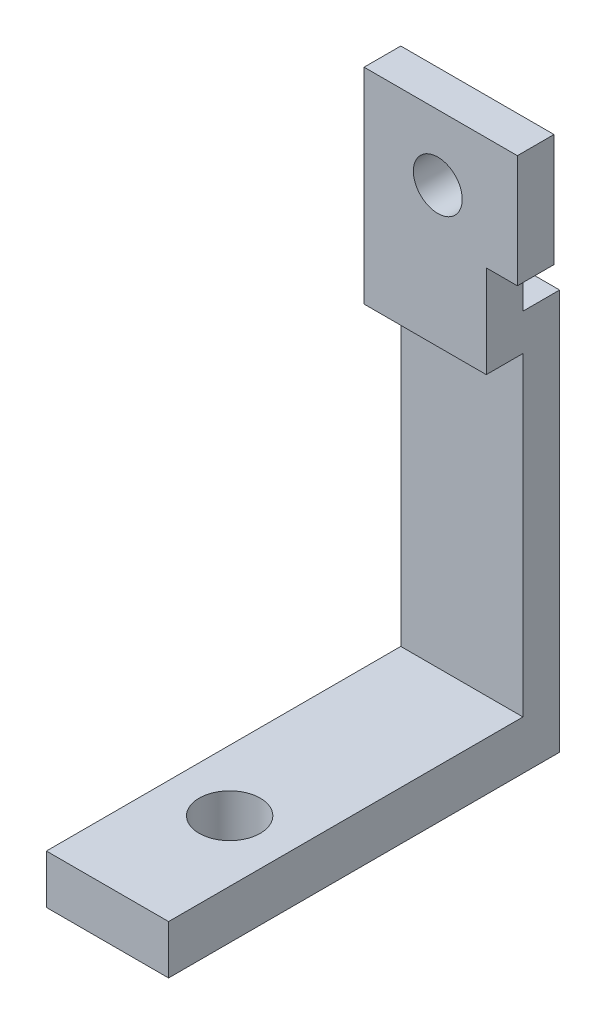
ISO-10303-21;
HEADER;
FILE_DESCRIPTION(('STEP AP214'),'2;1');
FILE_NAME('part.step','',(''),(''),'','','');
FILE_SCHEMA(('AUTOMOTIVE_DESIGN { 1 0 10303 214 1 1 1 1 }'));
ENDSEC;
DATA;
#1=APPLICATION_CONTEXT('core data for automotive mechanical design processes');
#2=APPLICATION_PROTOCOL_DEFINITION('international standard','automotive_design',2000,#1);
#3=PRODUCT_CONTEXT('',#1,'mechanical');
#4=PRODUCT('Part','Part','',(#3));
#5=PRODUCT_RELATED_PRODUCT_CATEGORY('part','',(#4));
#6=PRODUCT_DEFINITION_FORMATION('','',#4);
#7=PRODUCT_DEFINITION_CONTEXT('part definition',#1,'design');
#8=PRODUCT_DEFINITION('design','',#6,#7);
#9=PRODUCT_DEFINITION_SHAPE('','',#8);
#10=(LENGTH_UNIT() NAMED_UNIT(*) SI_UNIT(.MILLI.,.METRE.));
#11=(NAMED_UNIT(*) PLANE_ANGLE_UNIT() SI_UNIT($,.RADIAN.));
#12=(NAMED_UNIT(*) SI_UNIT($,.STERADIAN.) SOLID_ANGLE_UNIT());
#13=UNCERTAINTY_MEASURE_WITH_UNIT(LENGTH_MEASURE(1.E-05),#10,'distance_accuracy_value','');
#14=(GEOMETRIC_REPRESENTATION_CONTEXT(3) GLOBAL_UNCERTAINTY_ASSIGNED_CONTEXT((#13)) GLOBAL_UNIT_ASSIGNED_CONTEXT((#10,
#11,#12)) REPRESENTATION_CONTEXT('',''));
#15=CARTESIAN_POINT('',(0.,0.,0.));
#16=DIRECTION('',(0.,0.,1.));
#17=DIRECTION('',(1.,0.,0.));
#18=AXIS2_PLACEMENT_3D('',#15,#16,#17);
#19=CARTESIAN_POINT('',(0.,32.76,-29.));
#20=DIRECTION('',(0.,0.,-1.));
#21=DIRECTION('',(-1.,0.,0.));
#22=AXIS2_PLACEMENT_3D('',#19,#20,#21);
#23=PLANE('',#22);
#24=DIRECTION('',(1.,0.,0.));
#25=VECTOR('',#24,1.);
#26=CARTESIAN_POINT('',(0.,29.76,-29.));
#27=LINE('',#26,#25);
#28=CARTESIAN_POINT('',(0.,29.76,-29.));
#29=VERTEX_POINT('',#28);
#30=CARTESIAN_POINT('',(10.,29.76,-29.));
#31=VERTEX_POINT('',#30);
#32=EDGE_CURVE('E234',#29,#31,#27,.T.);
#33=ORIENTED_EDGE('',*,*,#32,.F.);
#34=DIRECTION('',(0.,-1.,0.));
#35=VECTOR('',#34,1.);
#36=CARTESIAN_POINT('',(0.,32.76,-29.));
#37=LINE('',#36,#35);
#38=CARTESIAN_POINT('',(0.,4.,-29.));
#39=VERTEX_POINT('',#38);
#40=EDGE_CURVE('E80',#29,#39,#37,.T.);
#41=ORIENTED_EDGE('',*,*,#40,.T.);
#42=DIRECTION('',(1.,0.,0.));
#43=VECTOR('',#42,1.);
#44=CARTESIAN_POINT('',(0.,4.,-29.));
#45=LINE('',#44,#43);
#46=CARTESIAN_POINT('',(10.,4.,-29.));
#47=VERTEX_POINT('',#46);
#48=EDGE_CURVE('E177',#39,#47,#45,.T.);
#49=ORIENTED_EDGE('',*,*,#48,.T.);
#50=DIRECTION('',(0.,-1.,0.));
#51=VECTOR('',#50,1.);
#52=CARTESIAN_POINT('',(10.,32.76,-29.));
#53=LINE('',#52,#51);
#54=EDGE_CURVE('E173',#31,#47,#53,.T.);
#55=ORIENTED_EDGE('',*,*,#54,.F.);
#56=EDGE_LOOP('',(#33,#41,#49,#55));
#57=FACE_BOUND('',#56,.T.);
#58=ADVANCED_FACE('F63',(#57),#23,.F.);
#59=CARTESIAN_POINT('',(0.,4.,0.));
#60=DIRECTION('',(0.,-1.,0.));
#61=DIRECTION('',(0.,0.,-1.));
#62=AXIS2_PLACEMENT_3D('',#59,#60,#61);
#63=PLANE('',#62);
#64=CARTESIAN_POINT('',(5.,4.,-10.));
#65=DIRECTION('',(0.,1.,0.));
#66=DIRECTION('',(0.,0.,1.));
#67=AXIS2_PLACEMENT_3D('',#64,#65,#66);
#68=CIRCLE('',#67,2.5);
#69=CARTESIAN_POINT('',(5.,4.,-7.5));
#70=VERTEX_POINT('',#69);
#71=EDGE_CURVE('E144',#70,#70,#68,.T.);
#72=ORIENTED_EDGE('',*,*,#71,.F.);
#73=EDGE_LOOP('',(#72));
#74=FACE_BOUND('',#73,.T.);
#75=ORIENTED_EDGE('',*,*,#48,.F.);
#76=DIRECTION('',(0.,0.,1.));
#77=VECTOR('',#76,1.);
#78=CARTESIAN_POINT('',(0.,4.,0.));
#79=LINE('',#78,#77);
#80=CARTESIAN_POINT('',(0.,4.,0.));
#81=VERTEX_POINT('',#80);
#82=EDGE_CURVE('E121',#39,#81,#79,.T.);
#83=ORIENTED_EDGE('',*,*,#82,.T.);
#84=DIRECTION('',(1.,0.,0.));
#85=VECTOR('',#84,1.);
#86=CARTESIAN_POINT('',(0.,4.,0.));
#87=LINE('',#86,#85);
#88=CARTESIAN_POINT('',(10.,4.,0.));
#89=VERTEX_POINT('',#88);
#90=EDGE_CURVE('E89',#81,#89,#87,.T.);
#91=ORIENTED_EDGE('',*,*,#90,.T.);
#92=DIRECTION('',(0.,0.,-1.));
#93=VECTOR('',#92,1.);
#94=CARTESIAN_POINT('',(10.,4.,0.));
#95=LINE('',#94,#93);
#96=EDGE_CURVE('E133',#89,#47,#95,.T.);
#97=ORIENTED_EDGE('',*,*,#96,.T.);
#98=EDGE_LOOP('',(#75,#83,#91,#97));
#99=FACE_BOUND('',#98,.T.);
#100=ADVANCED_FACE('F350',(#74,#99),#63,.F.);
#101=CARTESIAN_POINT('',(0.,4.,0.));
#102=DIRECTION('',(1.,0.,0.));
#103=DIRECTION('',(0.,0.,-1.));
#104=AXIS2_PLACEMENT_3D('',#101,#102,#103);
#105=PLANE('',#104);
#106=DIRECTION('',(0.,0.,1.));
#107=VECTOR('',#106,1.);
#108=CARTESIAN_POINT('',(0.,0.,0.));
#109=LINE('',#108,#107);
#110=CARTESIAN_POINT('',(0.,0.,-32.));
#111=VERTEX_POINT('',#110);
#112=CARTESIAN_POINT('',(0.,0.,0.));
#113=VERTEX_POINT('',#112);
#114=EDGE_CURVE('E128',#111,#113,#109,.T.);
#115=ORIENTED_EDGE('',*,*,#114,.T.);
#116=DIRECTION('',(0.,-1.,0.));
#117=VECTOR('',#116,1.);
#118=CARTESIAN_POINT('',(0.,4.,0.));
#119=LINE('',#118,#117);
#120=EDGE_CURVE('E12',#81,#113,#119,.T.);
#121=ORIENTED_EDGE('',*,*,#120,.F.);
#122=ORIENTED_EDGE('',*,*,#82,.F.);
#123=ORIENTED_EDGE('',*,*,#40,.F.);
#124=DIRECTION('',(0.,0.,-1.));
#125=VECTOR('',#124,1.);
#126=CARTESIAN_POINT('',(0.,29.76,-26.));
#127=LINE('',#126,#125);
#128=CARTESIAN_POINT('',(0.,29.76,-26.));
#129=VERTEX_POINT('',#128);
#130=EDGE_CURVE('E225',#129,#29,#127,.T.);
#131=ORIENTED_EDGE('',*,*,#130,.F.);
#132=DIRECTION('',(0.,1.,0.));
#133=VECTOR('',#132,1.);
#134=CARTESIAN_POINT('',(0.,29.76,-26.));
#135=LINE('',#134,#133);
#136=CARTESIAN_POINT('',(0.,46.5523620927674,-26.));
#137=VERTEX_POINT('',#136);
#138=EDGE_CURVE('E253',#129,#137,#135,.T.);
#139=ORIENTED_EDGE('',*,*,#138,.T.);
#140=DIRECTION('',(0.,0.,-1.));
#141=VECTOR('',#140,1.);
#142=CARTESIAN_POINT('',(0.,46.5523620927674,-26.));
#143=LINE('',#142,#141);
#144=CARTESIAN_POINT('',(0.,46.5523620927674,-29.));
#145=VERTEX_POINT('',#144);
#146=EDGE_CURVE('E206',#137,#145,#143,.T.);
#147=ORIENTED_EDGE('',*,*,#146,.T.);
#148=DIRECTION('',(0.,1.,0.));
#149=VECTOR('',#148,1.);
#150=CARTESIAN_POINT('',(0.,29.76,-29.));
#151=LINE('',#150,#149);
#152=CARTESIAN_POINT('',(0.,32.76,-29.));
#153=VERTEX_POINT('',#152);
#154=EDGE_CURVE('E239',#153,#145,#151,.T.);
#155=ORIENTED_EDGE('',*,*,#154,.F.);
#156=DIRECTION('',(0.,0.,1.));
#157=VECTOR('',#156,1.);
#158=CARTESIAN_POINT('',(0.,32.76,-32.));
#159=LINE('',#158,#157);
#160=CARTESIAN_POINT('',(0.,32.76,-32.));
#161=VERTEX_POINT('',#160);
#162=EDGE_CURVE('E131',#161,#153,#159,.T.);
#163=ORIENTED_EDGE('',*,*,#162,.F.);
#164=DIRECTION('',(0.,-1.,0.));
#165=VECTOR('',#164,1.);
#166=CARTESIAN_POINT('',(0.,4.,-32.));
#167=LINE('',#166,#165);
#168=EDGE_CURVE('E113',#161,#111,#167,.T.);
#169=ORIENTED_EDGE('',*,*,#168,.T.);
#170=EDGE_LOOP('',(#115,#121,#122,#123,#131,#139,#147,#155,#163,#169));
#171=FACE_BOUND('',#170,.T.);
#172=ADVANCED_FACE('F65',(#171),#105,.F.);
#173=CARTESIAN_POINT('',(0.,4.,0.));
#174=DIRECTION('',(0.,0.,-1.));
#175=DIRECTION('',(-1.,0.,0.));
#176=AXIS2_PLACEMENT_3D('',#173,#174,#175);
#177=PLANE('',#176);
#178=DIRECTION('',(1.,0.,0.));
#179=VECTOR('',#178,1.);
#180=CARTESIAN_POINT('',(0.,0.,0.));
#181=LINE('',#180,#179);
#182=CARTESIAN_POINT('',(10.,0.,0.));
#183=VERTEX_POINT('',#182);
#184=EDGE_CURVE('E136',#113,#183,#181,.T.);
#185=ORIENTED_EDGE('',*,*,#184,.T.);
#186=DIRECTION('',(0.,-1.,0.));
#187=VECTOR('',#186,1.);
#188=CARTESIAN_POINT('',(10.,4.,0.));
#189=LINE('',#188,#187);
#190=EDGE_CURVE('E73',#89,#183,#189,.T.);
#191=ORIENTED_EDGE('',*,*,#190,.F.);
#192=ORIENTED_EDGE('',*,*,#90,.F.);
#193=ORIENTED_EDGE('',*,*,#120,.T.);
#194=EDGE_LOOP('',(#185,#191,#192,#193));
#195=FACE_BOUND('',#194,.T.);
#196=ADVANCED_FACE('F160',(#195),#177,.F.);
#197=CARTESIAN_POINT('',(10.,4.,0.));
#198=DIRECTION('',(-1.,0.,0.));
#199=DIRECTION('',(0.,0.,1.));
#200=AXIS2_PLACEMENT_3D('',#197,#198,#199);
#201=PLANE('',#200);
#202=DIRECTION('',(0.,0.,-1.));
#203=VECTOR('',#202,1.);
#204=CARTESIAN_POINT('',(10.,0.,0.));
#205=LINE('',#204,#203);
#206=CARTESIAN_POINT('',(10.,0.,-32.));
#207=VERTEX_POINT('',#206);
#208=EDGE_CURVE('E122',#183,#207,#205,.T.);
#209=ORIENTED_EDGE('',*,*,#208,.T.);
#210=DIRECTION('',(0.,-1.,0.));
#211=VECTOR('',#210,1.);
#212=CARTESIAN_POINT('',(10.,4.,-32.));
#213=LINE('',#212,#211);
#214=CARTESIAN_POINT('',(10.,32.76,-32.));
#215=VERTEX_POINT('',#214);
#216=EDGE_CURVE('E116',#215,#207,#213,.T.);
#217=ORIENTED_EDGE('',*,*,#216,.F.);
#218=DIRECTION('',(0.,0.,-1.));
#219=VECTOR('',#218,1.);
#220=CARTESIAN_POINT('',(10.,32.76,-32.));
#221=LINE('',#220,#219);
#222=CARTESIAN_POINT('',(10.,32.76,-29.));
#223=VERTEX_POINT('',#222);
#224=EDGE_CURVE('E183',#223,#215,#221,.T.);
#225=ORIENTED_EDGE('',*,*,#224,.F.);
#226=DIRECTION('',(0.,1.,0.));
#227=VECTOR('',#226,1.);
#228=CARTESIAN_POINT('',(10.,29.76,-29.));
#229=LINE('',#228,#227);
#230=CARTESIAN_POINT('',(10.,37.3298178106664,-29.));
#231=VERTEX_POINT('',#230);
#232=EDGE_CURVE('E202',#223,#231,#229,.T.);
#233=ORIENTED_EDGE('',*,*,#232,.T.);
#234=DIRECTION('',(0.,0.,-1.));
#235=VECTOR('',#234,1.);
#236=CARTESIAN_POINT('',(10.,37.3298178106664,-26.));
#237=LINE('',#236,#235);
#238=CARTESIAN_POINT('',(10.,37.3298178106664,-26.));
#239=VERTEX_POINT('',#238);
#240=EDGE_CURVE('E180',#239,#231,#237,.T.);
#241=ORIENTED_EDGE('',*,*,#240,.F.);
#242=DIRECTION('',(0.,1.,0.));
#243=VECTOR('',#242,1.);
#244=CARTESIAN_POINT('',(10.,29.76,-26.));
#245=LINE('',#244,#243);
#246=CARTESIAN_POINT('',(10.,29.76,-26.));
#247=VERTEX_POINT('',#246);
#248=EDGE_CURVE('E238',#247,#239,#245,.T.);
#249=ORIENTED_EDGE('',*,*,#248,.F.);
#250=DIRECTION('',(0.,0.,-1.));
#251=VECTOR('',#250,1.);
#252=CARTESIAN_POINT('',(10.,29.76,-26.));
#253=LINE('',#252,#251);
#254=EDGE_CURVE('E229',#247,#31,#253,.T.);
#255=ORIENTED_EDGE('',*,*,#254,.T.);
#256=ORIENTED_EDGE('',*,*,#54,.T.);
#257=ORIENTED_EDGE('',*,*,#96,.F.);
#258=ORIENTED_EDGE('',*,*,#190,.T.);
#259=EDGE_LOOP('',(#209,#217,#225,#233,#241,#249,#255,#256,#257,#258));
#260=FACE_BOUND('',#259,.T.);
#261=ADVANCED_FACE('F157',(#260),#201,.F.);
#262=CARTESIAN_POINT('',(0.,4.,-32.));
#263=DIRECTION('',(0.,0.,1.));
#264=DIRECTION('',(1.,0.,0.));
#265=AXIS2_PLACEMENT_3D('',#262,#263,#264);
#266=PLANE('',#265);
#267=DIRECTION('',(-1.,0.,0.));
#268=VECTOR('',#267,1.);
#269=CARTESIAN_POINT('',(0.,0.,-32.));
#270=LINE('',#269,#268);
#271=EDGE_CURVE('E109',#207,#111,#270,.T.);
#272=ORIENTED_EDGE('',*,*,#271,.T.);
#273=ORIENTED_EDGE('',*,*,#168,.F.);
#274=DIRECTION('',(-1.,0.,0.));
#275=VECTOR('',#274,1.);
#276=CARTESIAN_POINT('',(0.,32.76,-32.));
#277=LINE('',#276,#275);
#278=EDGE_CURVE('E176',#215,#161,#277,.T.);
#279=ORIENTED_EDGE('',*,*,#278,.F.);
#280=ORIENTED_EDGE('',*,*,#216,.T.);
#281=EDGE_LOOP('',(#272,#273,#279,#280));
#282=FACE_BOUND('',#281,.T.);
#283=ADVANCED_FACE('F111',(#282),#266,.F.);
#284=CARTESIAN_POINT('',(0.,0.,0.));
#285=DIRECTION('',(0.,-1.,0.));
#286=DIRECTION('',(0.,0.,-1.));
#287=AXIS2_PLACEMENT_3D('',#284,#285,#286);
#288=PLANE('',#287);
#289=CARTESIAN_POINT('',(5.,0.,-10.));
#290=DIRECTION('',(0.,1.,0.));
#291=DIRECTION('',(0.,0.,1.));
#292=AXIS2_PLACEMENT_3D('',#289,#290,#291);
#293=CIRCLE('',#292,2.5);
#294=CARTESIAN_POINT('',(5.,0.,-7.5));
#295=VERTEX_POINT('',#294);
#296=EDGE_CURVE('E138',#295,#295,#293,.T.);
#297=ORIENTED_EDGE('',*,*,#296,.T.);
#298=EDGE_LOOP('',(#297));
#299=FACE_BOUND('',#298,.T.);
#300=ORIENTED_EDGE('',*,*,#114,.F.);
#301=ORIENTED_EDGE('',*,*,#271,.F.);
#302=ORIENTED_EDGE('',*,*,#208,.F.);
#303=ORIENTED_EDGE('',*,*,#184,.F.);
#304=EDGE_LOOP('',(#300,#301,#302,#303));
#305=FACE_BOUND('',#304,.T.);
#306=ADVANCED_FACE('F135',(#299,#305),#288,.T.);
#307=CARTESIAN_POINT('',(5.,0.,-10.));
#308=DIRECTION('',(0.,1.,0.));
#309=DIRECTION('',(0.,0.,1.));
#310=AXIS2_PLACEMENT_3D('',#307,#308,#309);
#311=CYLINDRICAL_SURFACE('',#310,2.5);
#312=ORIENTED_EDGE('',*,*,#296,.F.);
#313=EDGE_LOOP('',(#312));
#314=FACE_BOUND('',#313,.T.);
#315=ORIENTED_EDGE('',*,*,#71,.T.);
#316=EDGE_LOOP('',(#315));
#317=FACE_BOUND('',#316,.T.);
#318=ADVANCED_FACE('F360',(#314,#317),#311,.F.);
#319=CARTESIAN_POINT('',(0.,32.76,0.));
#320=DIRECTION('',(0.,1.,0.));
#321=DIRECTION('',(0.,0.,1.));
#322=AXIS2_PLACEMENT_3D('',#319,#320,#321);
#323=PLANE('',#322);
#324=ORIENTED_EDGE('',*,*,#162,.T.);
#325=DIRECTION('',(1.,0.,0.));
#326=VECTOR('',#325,1.);
#327=CARTESIAN_POINT('',(0.,32.76,-29.));
#328=LINE('',#327,#326);
#329=EDGE_CURVE('E187',#153,#223,#328,.T.);
#330=ORIENTED_EDGE('',*,*,#329,.T.);
#331=ORIENTED_EDGE('',*,*,#224,.T.);
#332=ORIENTED_EDGE('',*,*,#278,.T.);
#333=EDGE_LOOP('',(#324,#330,#331,#332));
#334=FACE_BOUND('',#333,.T.);
#335=ADVANCED_FACE('F293',(#334),#323,.T.);
#336=CARTESIAN_POINT('',(0.,46.5523620927674,-26.));
#337=DIRECTION('',(0.,1.,0.));
#338=DIRECTION('',(0.,0.,1.));
#339=AXIS2_PLACEMENT_3D('',#336,#337,#338);
#340=PLANE('',#339);
#341=DIRECTION('',(1.,0.,0.));
#342=VECTOR('',#341,1.);
#343=CARTESIAN_POINT('',(0.,46.5523620927674,-29.));
#344=LINE('',#343,#342);
#345=CARTESIAN_POINT('',(12.5429855419307,46.5523620927674,-29.));
#346=VERTEX_POINT('',#345);
#347=EDGE_CURVE('E243',#145,#346,#344,.T.);
#348=ORIENTED_EDGE('',*,*,#347,.F.);
#349=ORIENTED_EDGE('',*,*,#146,.F.);
#350=DIRECTION('',(1.,0.,0.));
#351=VECTOR('',#350,1.);
#352=CARTESIAN_POINT('',(0.,46.5523620927674,-26.));
#353=LINE('',#352,#351);
#354=CARTESIAN_POINT('',(12.5429855419307,46.5523620927674,-26.));
#355=VERTEX_POINT('',#354);
#356=EDGE_CURVE('E257',#137,#355,#353,.T.);
#357=ORIENTED_EDGE('',*,*,#356,.T.);
#358=DIRECTION('',(0.,0.,-1.));
#359=VECTOR('',#358,1.);
#360=CARTESIAN_POINT('',(12.5429855419307,46.5523620927674,-26.));
#361=LINE('',#360,#359);
#362=EDGE_CURVE('E193',#355,#346,#361,.T.);
#363=ORIENTED_EDGE('',*,*,#362,.T.);
#364=EDGE_LOOP('',(#348,#349,#357,#363));
#365=FACE_BOUND('',#364,.T.);
#366=ADVANCED_FACE('F324',(#365),#340,.T.);
#367=CARTESIAN_POINT('',(0.,29.76,-26.));
#368=DIRECTION('',(0.,1.,0.));
#369=DIRECTION('',(0.,0.,1.));
#370=AXIS2_PLACEMENT_3D('',#367,#368,#369);
#371=PLANE('',#370);
#372=ORIENTED_EDGE('',*,*,#32,.T.);
#373=ORIENTED_EDGE('',*,*,#254,.F.);
#374=DIRECTION('',(1.,0.,0.));
#375=VECTOR('',#374,1.);
#376=CARTESIAN_POINT('',(0.,29.76,-26.));
#377=LINE('',#376,#375);
#378=EDGE_CURVE('E233',#129,#247,#377,.T.);
#379=ORIENTED_EDGE('',*,*,#378,.F.);
#380=ORIENTED_EDGE('',*,*,#130,.T.);
#381=EDGE_LOOP('',(#372,#373,#379,#380));
#382=FACE_BOUND('',#381,.T.);
#383=ADVANCED_FACE('F332',(#382),#371,.F.);
#384=CARTESIAN_POINT('',(0.,0.,-26.));
#385=DIRECTION('',(0.,0.,-1.));
#386=DIRECTION('',(-1.,0.,0.));
#387=AXIS2_PLACEMENT_3D('',#384,#385,#386);
#388=PLANE('',#387);
#389=CARTESIAN_POINT('',(6.03043328851743,41.1994036623722,-26.));
#390=DIRECTION('',(0.,0.,1.));
#391=DIRECTION('',(1.,0.,0.));
#392=AXIS2_PLACEMENT_3D('',#389,#390,#391);
#393=CIRCLE('',#392,2.);
#394=CARTESIAN_POINT('',(8.03043328851743,41.1994036623722,-26.));
#395=VERTEX_POINT('',#394);
#396=EDGE_CURVE('E264',#395,#395,#393,.T.);
#397=ORIENTED_EDGE('',*,*,#396,.F.);
#398=EDGE_LOOP('',(#397));
#399=FACE_BOUND('',#398,.T.);
#400=ORIENTED_EDGE('',*,*,#248,.T.);
#401=DIRECTION('',(1.,0.,0.));
#402=VECTOR('',#401,1.);
#403=CARTESIAN_POINT('',(10.,37.3298178106664,-26.));
#404=LINE('',#403,#402);
#405=CARTESIAN_POINT('',(12.5429855419307,37.3298178106664,-26.));
#406=VERTEX_POINT('',#405);
#407=EDGE_CURVE('E198',#239,#406,#404,.T.);
#408=ORIENTED_EDGE('',*,*,#407,.T.);
#409=DIRECTION('',(0.,-1.,0.));
#410=VECTOR('',#409,1.);
#411=CARTESIAN_POINT('',(12.5429855419307,46.5523620927674,-26.));
#412=LINE('',#411,#410);
#413=EDGE_CURVE('E211',#355,#406,#412,.T.);
#414=ORIENTED_EDGE('',*,*,#413,.F.);
#415=ORIENTED_EDGE('',*,*,#356,.F.);
#416=ORIENTED_EDGE('',*,*,#138,.F.);
#417=ORIENTED_EDGE('',*,*,#378,.T.);
#418=EDGE_LOOP('',(#400,#408,#414,#415,#416,#417));
#419=FACE_BOUND('',#418,.T.);
#420=ADVANCED_FACE('F279',(#399,#419),#388,.F.);
#421=CARTESIAN_POINT('',(0.,0.,-29.));
#422=DIRECTION('',(0.,0.,-1.));
#423=DIRECTION('',(-1.,0.,0.));
#424=AXIS2_PLACEMENT_3D('',#421,#422,#423);
#425=PLANE('',#424);
#426=CARTESIAN_POINT('',(6.03043328851743,41.1994036623722,-29.));
#427=DIRECTION('',(0.,0.,-1.));
#428=DIRECTION('',(-1.,0.,0.));
#429=AXIS2_PLACEMENT_3D('',#426,#427,#428);
#430=CIRCLE('',#429,2.);
#431=CARTESIAN_POINT('',(4.03043328851743,41.1994036623722,-29.));
#432=VERTEX_POINT('',#431);
#433=EDGE_CURVE('E67',#432,#432,#430,.T.);
#434=ORIENTED_EDGE('',*,*,#433,.F.);
#435=EDGE_LOOP('',(#434));
#436=FACE_BOUND('',#435,.T.);
#437=ORIENTED_EDGE('',*,*,#232,.F.);
#438=ORIENTED_EDGE('',*,*,#329,.F.);
#439=ORIENTED_EDGE('',*,*,#154,.T.);
#440=ORIENTED_EDGE('',*,*,#347,.T.);
#441=DIRECTION('',(0.,-1.,0.));
#442=VECTOR('',#441,1.);
#443=CARTESIAN_POINT('',(12.5429855419307,46.5523620927674,-29.));
#444=LINE('',#443,#442);
#445=CARTESIAN_POINT('',(12.5429855419307,37.3298178106664,-29.));
#446=VERTEX_POINT('',#445);
#447=EDGE_CURVE('E212',#346,#446,#444,.T.);
#448=ORIENTED_EDGE('',*,*,#447,.T.);
#449=DIRECTION('',(1.,0.,0.));
#450=VECTOR('',#449,1.);
#451=CARTESIAN_POINT('',(10.,37.3298178106664,-29.));
#452=LINE('',#451,#450);
#453=EDGE_CURVE('E207',#231,#446,#452,.T.);
#454=ORIENTED_EDGE('',*,*,#453,.F.);
#455=EDGE_LOOP('',(#437,#438,#439,#440,#448,#454));
#456=FACE_BOUND('',#455,.T.);
#457=ADVANCED_FACE('F275',(#436,#456),#425,.T.);
#458=CARTESIAN_POINT('',(12.5429855419307,46.5523620927674,-26.));
#459=DIRECTION('',(1.,0.,0.));
#460=DIRECTION('',(0.,0.,-1.));
#461=AXIS2_PLACEMENT_3D('',#458,#459,#460);
#462=PLANE('',#461);
#463=ORIENTED_EDGE('',*,*,#447,.F.);
#464=ORIENTED_EDGE('',*,*,#362,.F.);
#465=ORIENTED_EDGE('',*,*,#413,.T.);
#466=DIRECTION('',(0.,0.,-1.));
#467=VECTOR('',#466,1.);
#468=CARTESIAN_POINT('',(12.5429855419307,37.3298178106664,-26.));
#469=LINE('',#468,#467);
#470=EDGE_CURVE('E197',#406,#446,#469,.T.);
#471=ORIENTED_EDGE('',*,*,#470,.T.);
#472=EDGE_LOOP('',(#463,#464,#465,#471));
#473=FACE_BOUND('',#472,.T.);
#474=ADVANCED_FACE('F278',(#473),#462,.T.);
#475=CARTESIAN_POINT('',(10.,37.3298178106664,-26.));
#476=DIRECTION('',(0.,1.,0.));
#477=DIRECTION('',(0.,0.,1.));
#478=AXIS2_PLACEMENT_3D('',#475,#476,#477);
#479=PLANE('',#478);
#480=ORIENTED_EDGE('',*,*,#453,.T.);
#481=ORIENTED_EDGE('',*,*,#470,.F.);
#482=ORIENTED_EDGE('',*,*,#407,.F.);
#483=ORIENTED_EDGE('',*,*,#240,.T.);
#484=EDGE_LOOP('',(#480,#481,#482,#483));
#485=FACE_BOUND('',#484,.T.);
#486=ADVANCED_FACE('F337',(#485),#479,.F.);
#487=CARTESIAN_POINT('',(6.03043328851743,41.1994036623722,-39.));
#488=DIRECTION('',(0.,0.,1.));
#489=DIRECTION('',(1.,0.,0.));
#490=AXIS2_PLACEMENT_3D('',#487,#488,#489);
#491=CYLINDRICAL_SURFACE('',#490,2.);
#492=ORIENTED_EDGE('',*,*,#433,.T.);
#493=EDGE_LOOP('',(#492));
#494=FACE_BOUND('',#493,.T.);
#495=ORIENTED_EDGE('',*,*,#396,.T.);
#496=EDGE_LOOP('',(#495));
#497=FACE_BOUND('',#496,.T.);
#498=ADVANCED_FACE('F273',(#494,#497),#491,.F.);
#499=CLOSED_SHELL('',(#58,#100,#172,#196,#261,#283,#306,#318,#335,#366,#383,#420,#457,#474,#486,#498));
#500=MANIFOLD_SOLID_BREP('B2',#499);
#501=ADVANCED_BREP_SHAPE_REPRESENTATION('',(#18,#500),#14);
#502=SHAPE_DEFINITION_REPRESENTATION(#9,#501);
ENDSEC;
END-ISO-10303-21;
